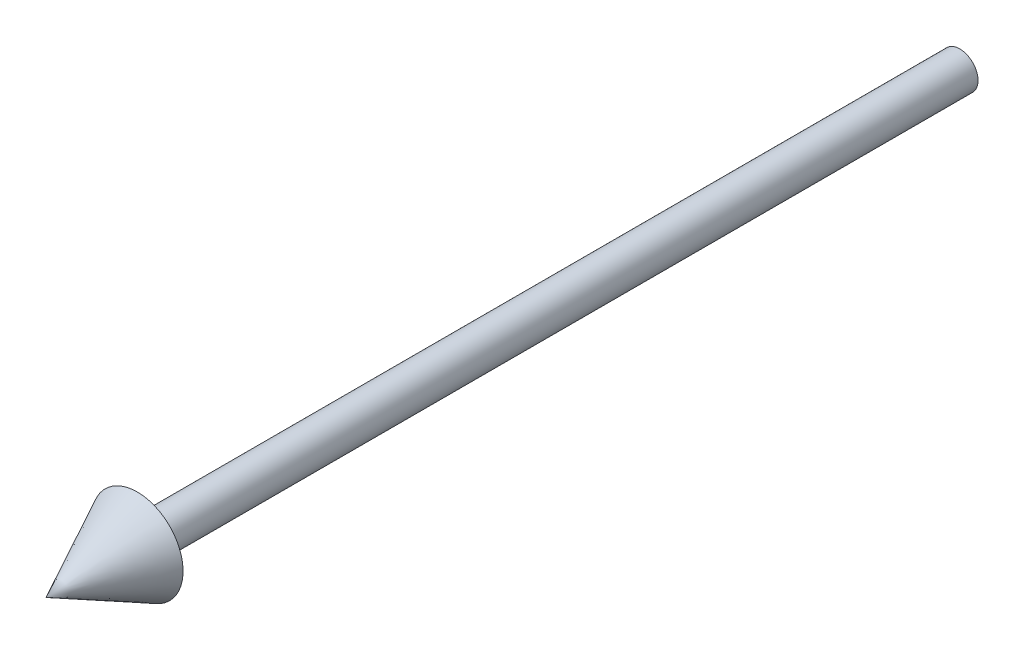
ISO-10303-21;
HEADER;
FILE_DESCRIPTION(('STEP AP214'),'2;1');
FILE_NAME('part.step','',(''),(''),'','','');
FILE_SCHEMA(('AUTOMOTIVE_DESIGN { 1 0 10303 214 1 1 1 1 }'));
ENDSEC;
DATA;
#1=APPLICATION_CONTEXT('core data for automotive mechanical design processes');
#2=APPLICATION_PROTOCOL_DEFINITION('international standard','automotive_design',2000,#1);
#3=PRODUCT_CONTEXT('',#1,'mechanical');
#4=PRODUCT('Part','Part','',(#3));
#5=PRODUCT_RELATED_PRODUCT_CATEGORY('part','',(#4));
#6=PRODUCT_DEFINITION_FORMATION('','',#4);
#7=PRODUCT_DEFINITION_CONTEXT('part definition',#1,'design');
#8=PRODUCT_DEFINITION('design','',#6,#7);
#9=PRODUCT_DEFINITION_SHAPE('','',#8);
#10=(LENGTH_UNIT() NAMED_UNIT(*) SI_UNIT(.MILLI.,.METRE.));
#11=(NAMED_UNIT(*) PLANE_ANGLE_UNIT() SI_UNIT($,.RADIAN.));
#12=(NAMED_UNIT(*) SI_UNIT($,.STERADIAN.) SOLID_ANGLE_UNIT());
#13=UNCERTAINTY_MEASURE_WITH_UNIT(LENGTH_MEASURE(1.E-05),#10,'distance_accuracy_value','');
#14=(GEOMETRIC_REPRESENTATION_CONTEXT(3) GLOBAL_UNCERTAINTY_ASSIGNED_CONTEXT((#13)) GLOBAL_UNIT_ASSIGNED_CONTEXT((#10,
#11,#12)) REPRESENTATION_CONTEXT('',''));
#15=CARTESIAN_POINT('',(0.,0.,0.));
#16=DIRECTION('',(0.,0.,1.));
#17=DIRECTION('',(1.,0.,0.));
#18=AXIS2_PLACEMENT_3D('',#15,#16,#17);
#19=CARTESIAN_POINT('',(2.,0.,0.));
#20=DIRECTION('',(0.,0.,1.));
#21=DIRECTION('',(1.,0.,0.));
#22=AXIS2_PLACEMENT_3D('',#19,#20,#21);
#23=PLANE('',#22);
#24=CARTESIAN_POINT('',(0.,0.,0.));
#25=DIRECTION('',(0.,0.,-1.));
#26=DIRECTION('',(-1.,0.,0.));
#27=AXIS2_PLACEMENT_3D('',#24,#25,#26);
#28=CIRCLE('',#27,2.);
#29=CARTESIAN_POINT('',(-2.,0.,0.));
#30=VERTEX_POINT('',#29);
#31=EDGE_CURVE('E11',#30,#30,#28,.T.);
#32=ORIENTED_EDGE('',*,*,#31,.T.);
#33=EDGE_LOOP('',(#32));
#34=FACE_BOUND('',#33,.T.);
#35=ADVANCED_FACE('F35',(#34),#23,.F.);
#36=CARTESIAN_POINT('',(0.,0.,-41.9499520246458));
#37=DIRECTION('',(0.,0.,-1.));
#38=DIRECTION('',(-1.,0.,0.));
#39=AXIS2_PLACEMENT_3D('',#36,#37,#38);
#40=CYLINDRICAL_SURFACE('',#39,2.);
#41=ORIENTED_EDGE('',*,*,#31,.F.);
#42=EDGE_LOOP('',(#41));
#43=FACE_BOUND('',#42,.T.);
#44=CARTESIAN_POINT('',(0.,0.,90.));
#45=DIRECTION('',(0.,0.,-1.));
#46=DIRECTION('',(-1.,0.,0.));
#47=AXIS2_PLACEMENT_3D('',#44,#45,#46);
#48=CIRCLE('',#47,2.);
#49=CARTESIAN_POINT('',(-2.,0.,90.));
#50=VERTEX_POINT('',#49);
#51=EDGE_CURVE('E41',#50,#50,#48,.T.);
#52=ORIENTED_EDGE('',*,*,#51,.T.);
#53=EDGE_LOOP('',(#52));
#54=FACE_BOUND('',#53,.T.);
#55=ADVANCED_FACE('F52',(#43,#54),#40,.T.);
#56=CARTESIAN_POINT('',(5.00000000000002,0.,90.));
#57=DIRECTION('',(0.,0.,1.));
#58=DIRECTION('',(1.,0.,0.));
#59=AXIS2_PLACEMENT_3D('',#56,#57,#58);
#60=PLANE('',#59);
#61=ORIENTED_EDGE('',*,*,#51,.F.);
#62=EDGE_LOOP('',(#61));
#63=FACE_BOUND('',#62,.T.);
#64=CARTESIAN_POINT('',(0.,0.,90.));
#65=DIRECTION('',(0.,0.,-1.));
#66=DIRECTION('',(-1.,0.,0.));
#67=AXIS2_PLACEMENT_3D('',#64,#65,#66);
#68=CIRCLE('',#67,5.00000000000002);
#69=CARTESIAN_POINT('',(-5.00000000000002,0.,90.));
#70=VERTEX_POINT('',#69);
#71=EDGE_CURVE('E66',#70,#70,#68,.T.);
#72=ORIENTED_EDGE('',*,*,#71,.T.);
#73=EDGE_LOOP('',(#72));
#74=FACE_BOUND('',#73,.T.);
#75=ADVANCED_FACE('F46',(#63,#74),#60,.F.);
#76=CARTESIAN_POINT('',(0.,0.,100.));
#77=DIRECTION('',(0.,0.,-1.));
#78=DIRECTION('',(-1.,0.,0.));
#79=AXIS2_PLACEMENT_3D('',#76,#77,#78);
#80=CONICAL_SURFACE('',#79,0.,0.463647609000807);
#81=ORIENTED_EDGE('',*,*,#71,.F.);
#82=EDGE_LOOP('',(#81));
#83=FACE_BOUND('',#82,.T.);
#84=CARTESIAN_POINT('',(0.,0.,100.));
#85=VERTEX_POINT('',#84);
#86=VERTEX_LOOP('',#85);
#87=FACE_BOUND('',#86,.T.);
#88=ADVANCED_FACE('F44',(#83,#87),#80,.T.);
#89=CLOSED_SHELL('',(#35,#55,#75,#88));
#90=MANIFOLD_SOLID_BREP('B2',#89);
#91=ADVANCED_BREP_SHAPE_REPRESENTATION('',(#18,#90),#14);
#92=SHAPE_DEFINITION_REPRESENTATION(#9,#91);
ENDSEC;
END-ISO-10303-21;
